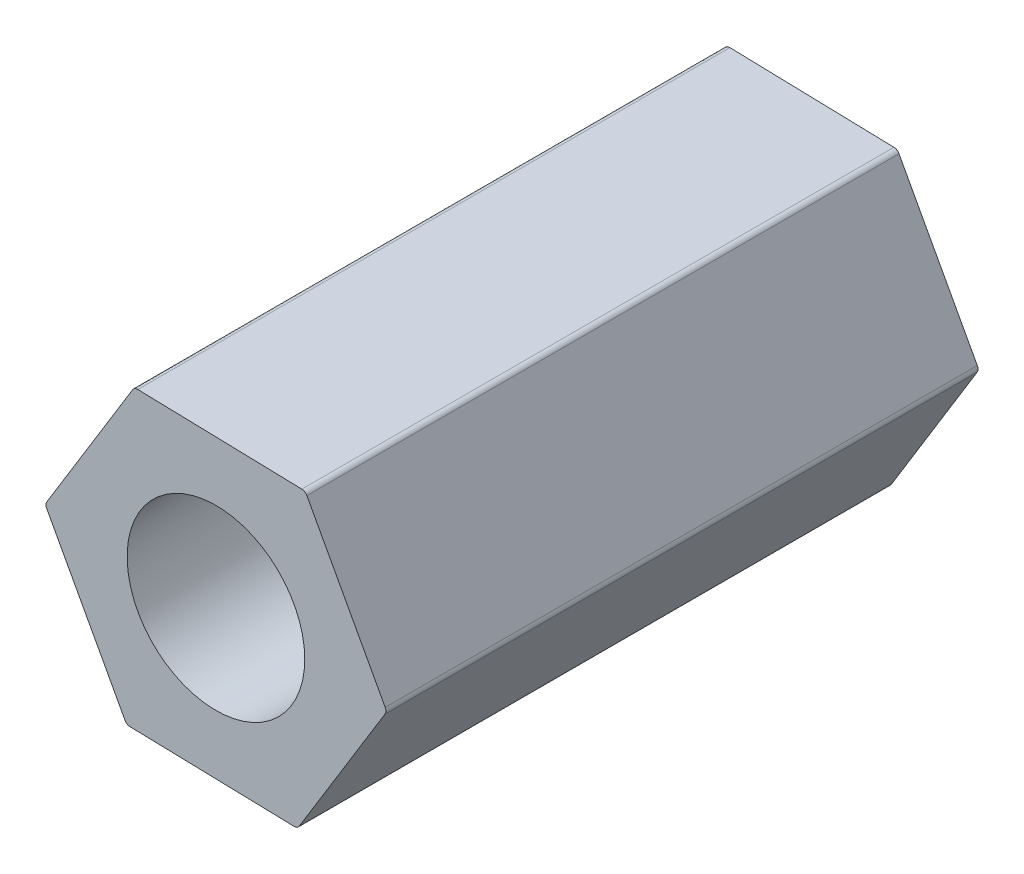
ISO-10303-21;
HEADER;
FILE_DESCRIPTION(('STEP AP214'),'2;1');
FILE_NAME('part.step','',(''),(''),'','','');
FILE_SCHEMA(('AUTOMOTIVE_DESIGN { 1 0 10303 214 1 1 1 1 }'));
ENDSEC;
DATA;
#1=APPLICATION_CONTEXT('core data for automotive mechanical design processes');
#2=APPLICATION_PROTOCOL_DEFINITION('international standard','automotive_design',2000,#1);
#3=PRODUCT_CONTEXT('',#1,'mechanical');
#4=PRODUCT('Part','Part','',(#3));
#5=PRODUCT_RELATED_PRODUCT_CATEGORY('part','',(#4));
#6=PRODUCT_DEFINITION_FORMATION('','',#4);
#7=PRODUCT_DEFINITION_CONTEXT('part definition',#1,'design');
#8=PRODUCT_DEFINITION('design','',#6,#7);
#9=PRODUCT_DEFINITION_SHAPE('','',#8);
#10=(LENGTH_UNIT() NAMED_UNIT(*) SI_UNIT(.MILLI.,.METRE.));
#11=(NAMED_UNIT(*) PLANE_ANGLE_UNIT() SI_UNIT($,.RADIAN.));
#12=(NAMED_UNIT(*) SI_UNIT($,.STERADIAN.) SOLID_ANGLE_UNIT());
#13=UNCERTAINTY_MEASURE_WITH_UNIT(LENGTH_MEASURE(1.E-05),#10,'distance_accuracy_value','');
#14=(GEOMETRIC_REPRESENTATION_CONTEXT(3) GLOBAL_UNCERTAINTY_ASSIGNED_CONTEXT((#13)) GLOBAL_UNIT_ASSIGNED_CONTEXT((#10,
#11,#12)) REPRESENTATION_CONTEXT('',''));
#15=CARTESIAN_POINT('',(0.,0.,0.));
#16=DIRECTION('',(0.,0.,1.));
#17=DIRECTION('',(1.,0.,0.));
#18=AXIS2_PLACEMENT_3D('',#15,#16,#17);
#19=CARTESIAN_POINT('',(2.88576042075985,-0.0756315232510881,10.));
#20=DIRECTION('',(-0.878827890320426,-0.477138909747413,0.));
#21=DIRECTION('',(0.477138909747413,-0.878827890320426,0.));
#22=AXIS2_PLACEMENT_3D('',#19,#20,#21);
#23=PLANE('',#22);
#24=DIRECTION('',(-0.477138909747413,0.878827890320426,0.));
#25=VECTOR('',#24,1.);
#26=CARTESIAN_POINT('',(2.88576042075985,-0.0756315232510881,10.));
#27=LINE('',#26,#25);
#28=CARTESIAN_POINT('',(2.8582127929615,-0.0248923713463028,10.));
#29=VERTEX_POINT('',#28);
#30=CARTESIAN_POINT('',(1.53592665864063,2.41058692008337,10.));
#31=VERTEX_POINT('',#30);
#32=EDGE_CURVE('E184',#29,#31,#27,.T.);
#33=ORIENTED_EDGE('',*,*,#32,.F.);
#34=DIRECTION('',(0.,0.,-1.));
#35=VECTOR('',#34,1.);
#36=CARTESIAN_POINT('',(2.8582127929615,-0.0248923713463028,10.));
#37=LINE('',#36,#35);
#38=CARTESIAN_POINT('',(2.8582127929615,-0.0248923713463028,0.));
#39=VERTEX_POINT('',#38);
#40=EDGE_CURVE('E11',#29,#39,#37,.T.);
#41=ORIENTED_EDGE('',*,*,#40,.T.);
#42=DIRECTION('',(-0.477138909747413,0.878827890320426,0.));
#43=VECTOR('',#42,1.);
#44=CARTESIAN_POINT('',(2.88576042075985,-0.0756315232510881,0.));
#45=LINE('',#44,#43);
#46=CARTESIAN_POINT('',(1.53592665864063,2.41058692008337,0.));
#47=VERTEX_POINT('',#46);
#48=EDGE_CURVE('E174',#39,#47,#45,.T.);
#49=ORIENTED_EDGE('',*,*,#48,.T.);
#50=DIRECTION('',(0.,0.,-1.));
#51=VECTOR('',#50,1.);
#52=CARTESIAN_POINT('',(1.53592665864063,2.41058692008337,10.));
#53=LINE('',#52,#51);
#54=EDGE_CURVE('E54',#47,#31,#53,.F.);
#55=ORIENTED_EDGE('',*,*,#54,.T.);
#56=EDGE_LOOP('',(#33,#41,#49,#55));
#57=FACE_BOUND('',#56,.T.);
#58=ADVANCED_FACE('F45',(#57),#23,.F.);
#59=CARTESIAN_POINT('',(1.50837903084228,2.46132607198815,10.));
#60=DIRECTION('',(-0.0261995281849424,-0.99965673344548,0.));
#61=DIRECTION('',(0.99965673344548,-0.0261995281849424,0.));
#62=AXIS2_PLACEMENT_3D('',#59,#60,#61);
#63=PLANE('',#62);
#64=DIRECTION('',(-0.99965673344548,0.0261995281849424,0.));
#65=VECTOR('',#64,1.);
#66=CARTESIAN_POINT('',(1.50837903084228,2.46132607198815,0.));
#67=LINE('',#66,#65);
#68=CARTESIAN_POINT('',(1.45066382242708,2.46283870245318,0.));
#69=VERTEX_POINT('',#68);
#70=CARTESIAN_POINT('',(-1.31966618150237,2.53544496477422,0.));
#71=VERTEX_POINT('',#70);
#72=EDGE_CURVE('E167',#69,#71,#67,.T.);
#73=ORIENTED_EDGE('',*,*,#72,.T.);
#74=DIRECTION('',(0.,0.,-1.));
#75=VECTOR('',#74,1.);
#76=CARTESIAN_POINT('',(-1.31966618150237,2.53544496477422,10.));
#77=LINE('',#76,#75);
#78=CARTESIAN_POINT('',(-1.31966618150237,2.53544496477422,10.));
#79=VERTEX_POINT('',#78);
#80=EDGE_CURVE('E142',#71,#79,#77,.F.);
#81=ORIENTED_EDGE('',*,*,#80,.T.);
#82=DIRECTION('',(-0.99965673344548,0.0261995281849424,0.));
#83=VECTOR('',#82,1.);
#84=CARTESIAN_POINT('',(1.50837903084228,2.46132607198815,10.));
#85=LINE('',#84,#83);
#86=CARTESIAN_POINT('',(1.45066382242708,2.46283870245318,10.));
#87=VERTEX_POINT('',#86);
#88=EDGE_CURVE('E257',#87,#79,#85,.T.);
#89=ORIENTED_EDGE('',*,*,#88,.F.);
#90=DIRECTION('',(0.,0.,-1.));
#91=VECTOR('',#90,1.);
#92=CARTESIAN_POINT('',(1.45066382242708,2.46283870245318,10.));
#93=LINE('',#92,#91);
#94=EDGE_CURVE('E148',#87,#69,#93,.T.);
#95=ORIENTED_EDGE('',*,*,#94,.T.);
#96=EDGE_LOOP('',(#73,#81,#89,#95));
#97=FACE_BOUND('',#96,.T.);
#98=ADVANCED_FACE('F261',(#97),#63,.F.);
#99=CARTESIAN_POINT('',(-1.37738138991757,2.53695759523924,10.));
#100=DIRECTION('',(0.852628362135483,-0.522517823698066,0.));
#101=DIRECTION('',(0.522517823698066,0.852628362135483,0.));
#102=AXIS2_PLACEMENT_3D('',#99,#100,#101);
#103=PLANE('',#102);
#104=DIRECTION('',(-0.522517823698066,-0.852628362135483,0.));
#105=VECTOR('',#104,1.);
#106=CARTESIAN_POINT('',(-1.37738138991757,2.53695759523924,10.));
#107=LINE('',#106,#105);
#108=CARTESIAN_POINT('',(-1.40754897053441,2.48773107379948,10.));
#109=VERTEX_POINT('',#108);
#110=CARTESIAN_POINT('',(-2.855592840143,0.124858044690851,10.));
#111=VERTEX_POINT('',#110);
#112=EDGE_CURVE('E158',#109,#111,#107,.T.);
#113=ORIENTED_EDGE('',*,*,#112,.F.);
#114=DIRECTION('',(0.,0.,-1.));
#115=VECTOR('',#114,1.);
#116=CARTESIAN_POINT('',(-1.40754897053441,2.48773107379948,10.));
#117=LINE('',#116,#115);
#118=CARTESIAN_POINT('',(-1.40754897053441,2.48773107379948,0.));
#119=VERTEX_POINT('',#118);
#120=EDGE_CURVE('E141',#109,#119,#117,.T.);
#121=ORIENTED_EDGE('',*,*,#120,.T.);
#122=DIRECTION('',(-0.522517823698066,-0.852628362135483,0.));
#123=VECTOR('',#122,1.);
#124=CARTESIAN_POINT('',(-1.37738138991757,2.53695759523924,0.));
#125=LINE('',#124,#123);
#126=CARTESIAN_POINT('',(-2.855592840143,0.124858044690851,0.));
#127=VERTEX_POINT('',#126);
#128=EDGE_CURVE('E155',#119,#127,#125,.T.);
#129=ORIENTED_EDGE('',*,*,#128,.T.);
#130=DIRECTION('',(0.,0.,-1.));
#131=VECTOR('',#130,1.);
#132=CARTESIAN_POINT('',(-2.855592840143,0.124858044690851,10.));
#133=LINE('',#132,#131);
#134=EDGE_CURVE('E161',#127,#111,#133,.F.);
#135=ORIENTED_EDGE('',*,*,#134,.T.);
#136=EDGE_LOOP('',(#113,#121,#129,#135));
#137=FACE_BOUND('',#136,.T.);
#138=ADVANCED_FACE('F154',(#137),#103,.F.);
#139=CARTESIAN_POINT('',(-2.88576042075985,0.0756315232510875,10.));
#140=DIRECTION('',(0.878827890320425,0.477138909747413,0.));
#141=DIRECTION('',(-0.477138909747413,0.878827890320426,0.));
#142=AXIS2_PLACEMENT_3D('',#139,#140,#141);
#143=PLANE('',#142);
#144=DIRECTION('',(0.477138909747413,-0.878827890320425,0.));
#145=VECTOR('',#144,1.);
#146=CARTESIAN_POINT('',(-2.88576042075985,0.0756315232510875,10.));
#147=LINE('',#146,#145);
#148=CARTESIAN_POINT('',(-2.8582127929615,0.0248923713463029,10.));
#149=VERTEX_POINT('',#148);
#150=CARTESIAN_POINT('',(-1.53592665864063,-2.41058692008337,10.));
#151=VERTEX_POINT('',#150);
#152=EDGE_CURVE('E275',#149,#151,#147,.T.);
#153=ORIENTED_EDGE('',*,*,#152,.F.);
#154=DIRECTION('',(0.,0.,-1.));
#155=VECTOR('',#154,1.);
#156=CARTESIAN_POINT('',(-2.8582127929615,0.0248923713463029,10.));
#157=LINE('',#156,#155);
#158=CARTESIAN_POINT('',(-2.8582127929615,0.0248923713463029,0.));
#159=VERTEX_POINT('',#158);
#160=EDGE_CURVE('E226',#149,#159,#157,.T.);
#161=ORIENTED_EDGE('',*,*,#160,.T.);
#162=DIRECTION('',(0.477138909747413,-0.878827890320425,0.));
#163=VECTOR('',#162,1.);
#164=CARTESIAN_POINT('',(-2.88576042075985,0.0756315232510875,0.));
#165=LINE('',#164,#163);
#166=CARTESIAN_POINT('',(-1.53592665864063,-2.41058692008337,0.));
#167=VERTEX_POINT('',#166);
#168=EDGE_CURVE('E166',#159,#167,#165,.T.);
#169=ORIENTED_EDGE('',*,*,#168,.T.);
#170=DIRECTION('',(0.,0.,-1.));
#171=VECTOR('',#170,1.);
#172=CARTESIAN_POINT('',(-1.53592665864063,-2.41058692008337,10.));
#173=LINE('',#172,#171);
#174=EDGE_CURVE('E223',#167,#151,#173,.F.);
#175=ORIENTED_EDGE('',*,*,#174,.T.);
#176=EDGE_LOOP('',(#153,#161,#169,#175));
#177=FACE_BOUND('',#176,.T.);
#178=ADVANCED_FACE('F387',(#177),#143,.F.);
#179=CARTESIAN_POINT('',(-1.50837903084228,-2.46132607198816,10.));
#180=DIRECTION('',(0.0261995281849419,0.99965673344548,0.));
#181=DIRECTION('',(-0.99965673344548,0.0261995281849419,0.));
#182=AXIS2_PLACEMENT_3D('',#179,#180,#181);
#183=PLANE('',#182);
#184=DIRECTION('',(0.99965673344548,-0.0261995281849419,0.));
#185=VECTOR('',#184,1.);
#186=CARTESIAN_POINT('',(-1.50837903084228,-2.46132607198816,10.));
#187=LINE('',#186,#185);
#188=CARTESIAN_POINT('',(-1.45066382242708,-2.46283870245318,10.));
#189=VERTEX_POINT('',#188);
#190=CARTESIAN_POINT('',(1.31966618150237,-2.53544496477422,10.));
#191=VERTEX_POINT('',#190);
#192=EDGE_CURVE('E272',#189,#191,#187,.T.);
#193=ORIENTED_EDGE('',*,*,#192,.F.);
#194=DIRECTION('',(0.,0.,-1.));
#195=VECTOR('',#194,1.);
#196=CARTESIAN_POINT('',(-1.45066382242708,-2.46283870245318,10.));
#197=LINE('',#196,#195);
#198=CARTESIAN_POINT('',(-1.45066382242708,-2.46283870245318,0.));
#199=VERTEX_POINT('',#198);
#200=EDGE_CURVE('E233',#189,#199,#197,.T.);
#201=ORIENTED_EDGE('',*,*,#200,.T.);
#202=DIRECTION('',(0.99965673344548,-0.0261995281849419,0.));
#203=VECTOR('',#202,1.);
#204=CARTESIAN_POINT('',(-1.50837903084228,-2.46132607198816,0.));
#205=LINE('',#204,#203);
#206=CARTESIAN_POINT('',(1.31966618150237,-2.53544496477422,0.));
#207=VERTEX_POINT('',#206);
#208=EDGE_CURVE('E172',#199,#207,#205,.T.);
#209=ORIENTED_EDGE('',*,*,#208,.T.);
#210=DIRECTION('',(0.,0.,-1.));
#211=VECTOR('',#210,1.);
#212=CARTESIAN_POINT('',(1.31966618150237,-2.53544496477422,10.));
#213=LINE('',#212,#211);
#214=EDGE_CURVE('E230',#207,#191,#213,.F.);
#215=ORIENTED_EDGE('',*,*,#214,.T.);
#216=EDGE_LOOP('',(#193,#201,#209,#215));
#217=FACE_BOUND('',#216,.T.);
#218=ADVANCED_FACE('F298',(#217),#183,.F.);
#219=CARTESIAN_POINT('',(1.37738138991757,-2.53695759523924,10.));
#220=DIRECTION('',(-0.852628362135483,0.522517823698066,0.));
#221=DIRECTION('',(-0.522517823698066,-0.852628362135483,0.));
#222=AXIS2_PLACEMENT_3D('',#219,#220,#221);
#223=PLANE('',#222);
#224=DIRECTION('',(0.522517823698066,0.852628362135483,0.));
#225=VECTOR('',#224,1.);
#226=CARTESIAN_POINT('',(1.37738138991757,-2.53695759523924,10.));
#227=LINE('',#226,#225);
#228=CARTESIAN_POINT('',(1.40754897053441,-2.48773107379948,10.));
#229=VERTEX_POINT('',#228);
#230=CARTESIAN_POINT('',(2.855592840143,-0.12485804469085,10.));
#231=VERTEX_POINT('',#230);
#232=EDGE_CURVE('E186',#229,#231,#227,.T.);
#233=ORIENTED_EDGE('',*,*,#232,.F.);
#234=DIRECTION('',(0.,0.,-1.));
#235=VECTOR('',#234,1.);
#236=CARTESIAN_POINT('',(1.40754897053441,-2.48773107379948,10.));
#237=LINE('',#236,#235);
#238=CARTESIAN_POINT('',(1.40754897053441,-2.48773107379948,0.));
#239=VERTEX_POINT('',#238);
#240=EDGE_CURVE('E239',#229,#239,#237,.T.);
#241=ORIENTED_EDGE('',*,*,#240,.T.);
#242=DIRECTION('',(0.522517823698066,0.852628362135483,0.));
#243=VECTOR('',#242,1.);
#244=CARTESIAN_POINT('',(1.37738138991757,-2.53695759523924,0.));
#245=LINE('',#244,#243);
#246=CARTESIAN_POINT('',(2.855592840143,-0.12485804469085,0.));
#247=VERTEX_POINT('',#246);
#248=EDGE_CURVE('E181',#239,#247,#245,.T.);
#249=ORIENTED_EDGE('',*,*,#248,.T.);
#250=DIRECTION('',(0.,0.,-1.));
#251=VECTOR('',#250,1.);
#252=CARTESIAN_POINT('',(2.855592840143,-0.124858044690851,10.));
#253=LINE('',#252,#251);
#254=EDGE_CURVE('E61',#247,#231,#253,.F.);
#255=ORIENTED_EDGE('',*,*,#254,.T.);
#256=EDGE_LOOP('',(#233,#241,#249,#255));
#257=FACE_BOUND('',#256,.T.);
#258=ADVANCED_FACE('F290',(#257),#223,.F.);
#259=CARTESIAN_POINT('',(0.,0.,10.));
#260=DIRECTION('',(0.,0.,1.));
#261=DIRECTION('',(1.,0.,0.));
#262=AXIS2_PLACEMENT_3D('',#259,#260,#261);
#263=PLANE('',#262);
#264=CARTESIAN_POINT('',(0.,0.,10.));
#265=DIRECTION('',(0.,0.,1.));
#266=DIRECTION('',(1.,0.,0.));
#267=AXIS2_PLACEMENT_3D('',#264,#265,#266);
#268=CIRCLE('',#267,1.49999999999999);
#269=CARTESIAN_POINT('',(1.49999999999999,0.,10.));
#270=VERTEX_POINT('',#269);
#271=EDGE_CURVE('E267',#270,#270,#268,.T.);
#272=ORIENTED_EDGE('',*,*,#271,.F.);
#273=EDGE_LOOP('',(#272));
#274=FACE_BOUND('',#273,.T.);
#275=ORIENTED_EDGE('',*,*,#88,.T.);
#276=CARTESIAN_POINT('',(-1.32228613432087,2.43547929142967,10.));
#277=DIRECTION('',(0.,0.,1.));
#278=DIRECTION('',(1.,0.,0.));
#279=AXIS2_PLACEMENT_3D('',#276,#277,#278);
#280=CIRCLE('',#279,0.1);
#281=EDGE_CURVE('E220',#79,#109,#280,.T.);
#282=ORIENTED_EDGE('',*,*,#281,.T.);
#283=ORIENTED_EDGE('',*,*,#112,.T.);
#284=CARTESIAN_POINT('',(-2.77033000392945,0.0726062623210441,10.));
#285=DIRECTION('',(0.,0.,1.));
#286=DIRECTION('',(1.,0.,0.));
#287=AXIS2_PLACEMENT_3D('',#284,#285,#286);
#288=CIRCLE('',#287,0.1);
#289=EDGE_CURVE('E217',#111,#149,#288,.T.);
#290=ORIENTED_EDGE('',*,*,#289,.T.);
#291=ORIENTED_EDGE('',*,*,#152,.T.);
#292=CARTESIAN_POINT('',(-1.44804386960859,-2.36287302910863,10.));
#293=DIRECTION('',(0.,0.,1.));
#294=DIRECTION('',(1.,0.,0.));
#295=AXIS2_PLACEMENT_3D('',#292,#293,#294);
#296=CIRCLE('',#295,0.1);
#297=EDGE_CURVE('E214',#151,#189,#296,.T.);
#298=ORIENTED_EDGE('',*,*,#297,.T.);
#299=ORIENTED_EDGE('',*,*,#192,.T.);
#300=CARTESIAN_POINT('',(1.32228613432086,-2.43547929142967,10.));
#301=DIRECTION('',(0.,0.,1.));
#302=DIRECTION('',(1.,0.,0.));
#303=AXIS2_PLACEMENT_3D('',#300,#301,#302);
#304=CIRCLE('',#303,0.1);
#305=EDGE_CURVE('E68',#191,#229,#304,.T.);
#306=ORIENTED_EDGE('',*,*,#305,.T.);
#307=ORIENTED_EDGE('',*,*,#232,.T.);
#308=CARTESIAN_POINT('',(2.77033000392945,-0.0726062623210442,10.));
#309=DIRECTION('',(0.,0.,1.));
#310=DIRECTION('',(1.,0.,0.));
#311=AXIS2_PLACEMENT_3D('',#308,#309,#310);
#312=CIRCLE('',#311,0.1);
#313=EDGE_CURVE('E209',#231,#29,#312,.T.);
#314=ORIENTED_EDGE('',*,*,#313,.T.);
#315=ORIENTED_EDGE('',*,*,#32,.T.);
#316=CARTESIAN_POINT('',(1.44804386960859,2.36287302910863,10.));
#317=DIRECTION('',(0.,0.,1.));
#318=DIRECTION('',(1.,0.,0.));
#319=AXIS2_PLACEMENT_3D('',#316,#317,#318);
#320=CIRCLE('',#319,0.1);
#321=EDGE_CURVE('E206',#31,#87,#320,.T.);
#322=ORIENTED_EDGE('',*,*,#321,.T.);
#323=EDGE_LOOP('',(#275,#282,#283,#290,#291,#298,#299,#306,#307,#314,#315,#322));
#324=FACE_BOUND('',#323,.T.);
#325=ADVANCED_FACE('F253',(#274,#324),#263,.T.);
#326=CARTESIAN_POINT('',(0.,0.,0.));
#327=DIRECTION('',(0.,0.,1.));
#328=DIRECTION('',(1.,0.,0.));
#329=AXIS2_PLACEMENT_3D('',#326,#327,#328);
#330=PLANE('',#329);
#331=CARTESIAN_POINT('',(0.,0.,0.));
#332=DIRECTION('',(0.,0.,1.));
#333=DIRECTION('',(1.,0.,0.));
#334=AXIS2_PLACEMENT_3D('',#331,#332,#333);
#335=CIRCLE('',#334,1.49999999999999);
#336=CARTESIAN_POINT('',(1.49999999999999,0.,0.));
#337=VERTEX_POINT('',#336);
#338=EDGE_CURVE('E264',#337,#337,#335,.T.);
#339=ORIENTED_EDGE('',*,*,#338,.T.);
#340=EDGE_LOOP('',(#339));
#341=FACE_BOUND('',#340,.T.);
#342=ORIENTED_EDGE('',*,*,#128,.F.);
#343=CARTESIAN_POINT('',(-1.32228613432087,2.43547929142967,0.));
#344=DIRECTION('',(0.,0.,1.));
#345=DIRECTION('',(1.,0.,0.));
#346=AXIS2_PLACEMENT_3D('',#343,#344,#345);
#347=CIRCLE('',#346,0.1);
#348=EDGE_CURVE('E137',#119,#71,#347,.F.);
#349=ORIENTED_EDGE('',*,*,#348,.T.);
#350=ORIENTED_EDGE('',*,*,#72,.F.);
#351=CARTESIAN_POINT('',(1.44804386960859,2.36287302910863,0.));
#352=DIRECTION('',(0.,0.,1.));
#353=DIRECTION('',(1.,0.,0.));
#354=AXIS2_PLACEMENT_3D('',#351,#352,#353);
#355=CIRCLE('',#354,0.1);
#356=EDGE_CURVE('E160',#69,#47,#355,.F.);
#357=ORIENTED_EDGE('',*,*,#356,.T.);
#358=ORIENTED_EDGE('',*,*,#48,.F.);
#359=CARTESIAN_POINT('',(2.77033000392945,-0.0726062623210442,0.));
#360=DIRECTION('',(0.,0.,1.));
#361=DIRECTION('',(1.,0.,0.));
#362=AXIS2_PLACEMENT_3D('',#359,#360,#361);
#363=CIRCLE('',#362,0.1);
#364=EDGE_CURVE('E190',#39,#247,#363,.F.);
#365=ORIENTED_EDGE('',*,*,#364,.T.);
#366=ORIENTED_EDGE('',*,*,#248,.F.);
#367=CARTESIAN_POINT('',(1.32228613432086,-2.43547929142967,0.));
#368=DIRECTION('',(0.,0.,1.));
#369=DIRECTION('',(1.,0.,0.));
#370=AXIS2_PLACEMENT_3D('',#367,#368,#369);
#371=CIRCLE('',#370,0.1);
#372=EDGE_CURVE('E193',#239,#207,#371,.F.);
#373=ORIENTED_EDGE('',*,*,#372,.T.);
#374=ORIENTED_EDGE('',*,*,#208,.F.);
#375=CARTESIAN_POINT('',(-1.44804386960859,-2.36287302910863,0.));
#376=DIRECTION('',(0.,0.,1.));
#377=DIRECTION('',(1.,0.,0.));
#378=AXIS2_PLACEMENT_3D('',#375,#376,#377);
#379=CIRCLE('',#378,0.1);
#380=EDGE_CURVE('E196',#199,#167,#379,.F.);
#381=ORIENTED_EDGE('',*,*,#380,.T.);
#382=ORIENTED_EDGE('',*,*,#168,.F.);
#383=CARTESIAN_POINT('',(-2.77033000392945,0.0726062623210441,0.));
#384=DIRECTION('',(0.,0.,1.));
#385=DIRECTION('',(1.,0.,0.));
#386=AXIS2_PLACEMENT_3D('',#383,#384,#385);
#387=CIRCLE('',#386,0.1);
#388=EDGE_CURVE('E149',#159,#127,#387,.F.);
#389=ORIENTED_EDGE('',*,*,#388,.T.);
#390=EDGE_LOOP('',(#342,#349,#350,#357,#358,#365,#366,#373,#374,#381,#382,#389));
#391=FACE_BOUND('',#390,.T.);
#392=ADVANCED_FACE('F163',(#341,#391),#330,.F.);
#393=CARTESIAN_POINT('',(0.,0.,10.));
#394=DIRECTION('',(0.,0.,1.));
#395=DIRECTION('',(1.,0.,0.));
#396=AXIS2_PLACEMENT_3D('',#393,#394,#395);
#397=CYLINDRICAL_SURFACE('',#396,1.49999999999999);
#398=ORIENTED_EDGE('',*,*,#338,.F.);
#399=EDGE_LOOP('',(#398));
#400=FACE_BOUND('',#399,.T.);
#401=ORIENTED_EDGE('',*,*,#271,.T.);
#402=EDGE_LOOP('',(#401));
#403=FACE_BOUND('',#402,.T.);
#404=ADVANCED_FACE('F287',(#400,#403),#397,.F.);
#405=CARTESIAN_POINT('',(-1.32228613432087,2.43547929142967,10.));
#406=DIRECTION('',(0.,0.,-1.));
#407=DIRECTION('',(-1.,0.,0.));
#408=AXIS2_PLACEMENT_3D('',#405,#406,#407);
#409=CYLINDRICAL_SURFACE('',#408,0.1);
#410=ORIENTED_EDGE('',*,*,#281,.F.);
#411=ORIENTED_EDGE('',*,*,#80,.F.);
#412=ORIENTED_EDGE('',*,*,#348,.F.);
#413=ORIENTED_EDGE('',*,*,#120,.F.);
#414=EDGE_LOOP('',(#410,#411,#412,#413));
#415=FACE_BOUND('',#414,.T.);
#416=ADVANCED_FACE('F140',(#415),#409,.T.);
#417=CARTESIAN_POINT('',(-2.77033000392945,0.0726062623210441,10.));
#418=DIRECTION('',(0.,0.,-1.));
#419=DIRECTION('',(-1.,0.,0.));
#420=AXIS2_PLACEMENT_3D('',#417,#418,#419);
#421=CYLINDRICAL_SURFACE('',#420,0.1);
#422=ORIENTED_EDGE('',*,*,#289,.F.);
#423=ORIENTED_EDGE('',*,*,#134,.F.);
#424=ORIENTED_EDGE('',*,*,#388,.F.);
#425=ORIENTED_EDGE('',*,*,#160,.F.);
#426=EDGE_LOOP('',(#422,#423,#424,#425));
#427=FACE_BOUND('',#426,.T.);
#428=ADVANCED_FACE('F311',(#427),#421,.T.);
#429=CARTESIAN_POINT('',(-1.44804386960859,-2.36287302910863,10.));
#430=DIRECTION('',(0.,0.,-1.));
#431=DIRECTION('',(-1.,0.,0.));
#432=AXIS2_PLACEMENT_3D('',#429,#430,#431);
#433=CYLINDRICAL_SURFACE('',#432,0.1);
#434=ORIENTED_EDGE('',*,*,#297,.F.);
#435=ORIENTED_EDGE('',*,*,#174,.F.);
#436=ORIENTED_EDGE('',*,*,#380,.F.);
#437=ORIENTED_EDGE('',*,*,#200,.F.);
#438=EDGE_LOOP('',(#434,#435,#436,#437));
#439=FACE_BOUND('',#438,.T.);
#440=ADVANCED_FACE('F314',(#439),#433,.T.);
#441=CARTESIAN_POINT('',(1.32228613432086,-2.43547929142967,10.));
#442=DIRECTION('',(0.,0.,-1.));
#443=DIRECTION('',(-1.,0.,0.));
#444=AXIS2_PLACEMENT_3D('',#441,#442,#443);
#445=CYLINDRICAL_SURFACE('',#444,0.1);
#446=ORIENTED_EDGE('',*,*,#305,.F.);
#447=ORIENTED_EDGE('',*,*,#214,.F.);
#448=ORIENTED_EDGE('',*,*,#372,.F.);
#449=ORIENTED_EDGE('',*,*,#240,.F.);
#450=EDGE_LOOP('',(#446,#447,#448,#449));
#451=FACE_BOUND('',#450,.T.);
#452=ADVANCED_FACE('F318',(#451),#445,.T.);
#453=CARTESIAN_POINT('',(2.77033000392945,-0.0726062623210442,10.));
#454=DIRECTION('',(0.,0.,-1.));
#455=DIRECTION('',(-1.,0.,0.));
#456=AXIS2_PLACEMENT_3D('',#453,#454,#455);
#457=CYLINDRICAL_SURFACE('',#456,0.1);
#458=ORIENTED_EDGE('',*,*,#313,.F.);
#459=ORIENTED_EDGE('',*,*,#254,.F.);
#460=ORIENTED_EDGE('',*,*,#364,.F.);
#461=ORIENTED_EDGE('',*,*,#40,.F.);
#462=EDGE_LOOP('',(#458,#459,#460,#461));
#463=FACE_BOUND('',#462,.T.);
#464=ADVANCED_FACE('F321',(#463),#457,.T.);
#465=CARTESIAN_POINT('',(1.44804386960859,2.36287302910863,10.));
#466=DIRECTION('',(0.,0.,-1.));
#467=DIRECTION('',(-1.,0.,0.));
#468=AXIS2_PLACEMENT_3D('',#465,#466,#467);
#469=CYLINDRICAL_SURFACE('',#468,0.1);
#470=ORIENTED_EDGE('',*,*,#321,.F.);
#471=ORIENTED_EDGE('',*,*,#54,.F.);
#472=ORIENTED_EDGE('',*,*,#356,.F.);
#473=ORIENTED_EDGE('',*,*,#94,.F.);
#474=EDGE_LOOP('',(#470,#471,#472,#473));
#475=FACE_BOUND('',#474,.T.);
#476=ADVANCED_FACE('F47',(#475),#469,.T.);
#477=CLOSED_SHELL('',(#58,#98,#138,#178,#218,#258,#325,#392,#404,#416,#428,#440,#452,#464,#476));
#478=MANIFOLD_SOLID_BREP('B2',#477);
#479=ADVANCED_BREP_SHAPE_REPRESENTATION('',(#18,#478),#14);
#480=SHAPE_DEFINITION_REPRESENTATION(#9,#479);
ENDSEC;
END-ISO-10303-21;
